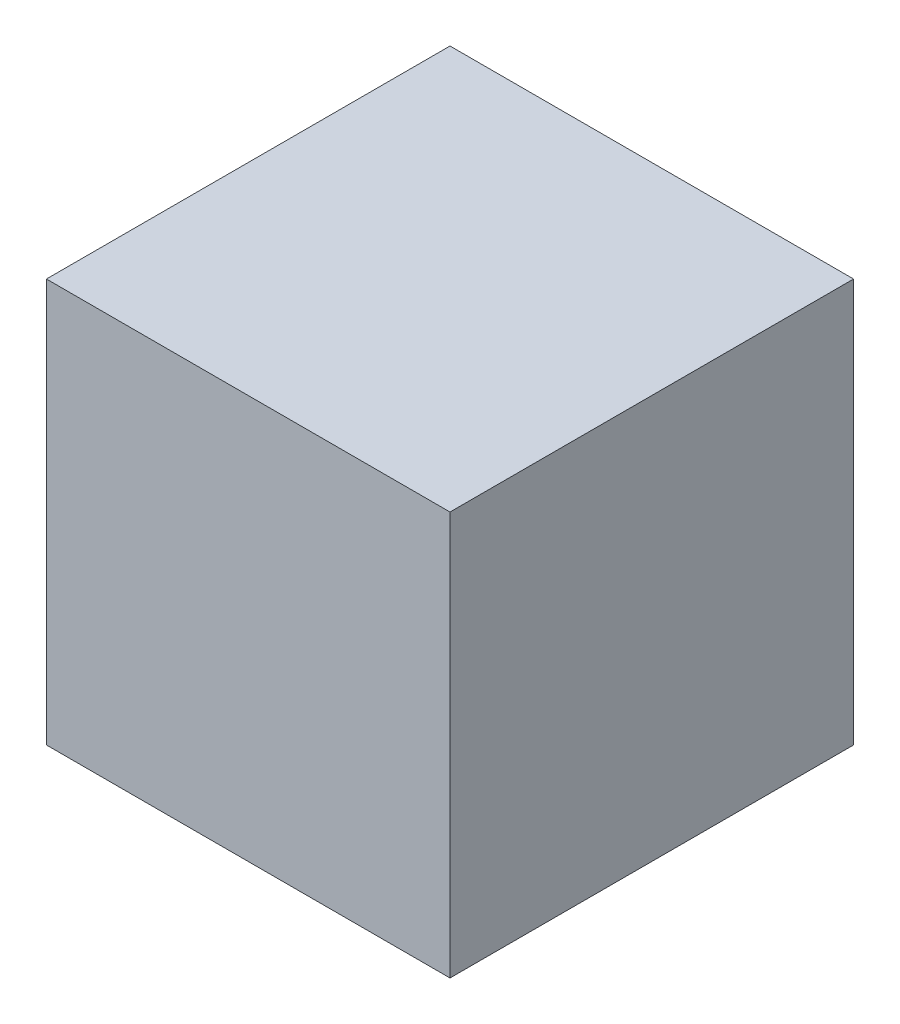
ISO-10303-21;
HEADER;
FILE_DESCRIPTION(('STEP AP214'),'2;1');
FILE_NAME('part.step','',(''),(''),'','','');
FILE_SCHEMA(('AUTOMOTIVE_DESIGN { 1 0 10303 214 1 1 1 1 }'));
ENDSEC;
DATA;
#1=APPLICATION_CONTEXT('core data for automotive mechanical design processes');
#2=APPLICATION_PROTOCOL_DEFINITION('international standard','automotive_design',2000,#1);
#3=PRODUCT_CONTEXT('',#1,'mechanical');
#4=PRODUCT('Part','Part','',(#3));
#5=PRODUCT_RELATED_PRODUCT_CATEGORY('part','',(#4));
#6=PRODUCT_DEFINITION_FORMATION('','',#4);
#7=PRODUCT_DEFINITION_CONTEXT('part definition',#1,'design');
#8=PRODUCT_DEFINITION('design','',#6,#7);
#9=PRODUCT_DEFINITION_SHAPE('','',#8);
#10=(LENGTH_UNIT() NAMED_UNIT(*) SI_UNIT(.MILLI.,.METRE.));
#11=(NAMED_UNIT(*) PLANE_ANGLE_UNIT() SI_UNIT($,.RADIAN.));
#12=(NAMED_UNIT(*) SI_UNIT($,.STERADIAN.) SOLID_ANGLE_UNIT());
#13=UNCERTAINTY_MEASURE_WITH_UNIT(LENGTH_MEASURE(1.E-05),#10,'distance_accuracy_value','');
#14=(GEOMETRIC_REPRESENTATION_CONTEXT(3) GLOBAL_UNCERTAINTY_ASSIGNED_CONTEXT((#13)) GLOBAL_UNIT_ASSIGNED_CONTEXT((#10,
#11,#12)) REPRESENTATION_CONTEXT('',''));
#15=CARTESIAN_POINT('',(0.,0.,0.));
#16=DIRECTION('',(0.,0.,1.));
#17=DIRECTION('',(1.,0.,0.));
#18=AXIS2_PLACEMENT_3D('',#15,#16,#17);
#19=CARTESIAN_POINT('',(12.5,-12.5,12.5));
#20=DIRECTION('',(-1.,0.,0.));
#21=DIRECTION('',(0.,0.,1.));
#22=AXIS2_PLACEMENT_3D('',#19,#20,#21);
#23=PLANE('',#22);
#24=DIRECTION('',(0.,1.,0.));
#25=VECTOR('',#24,1.);
#26=CARTESIAN_POINT('',(12.5,-12.5,-12.5));
#27=LINE('',#26,#25);
#28=CARTESIAN_POINT('',(12.5,-12.5,-12.5));
#29=VERTEX_POINT('',#28);
#30=CARTESIAN_POINT('',(12.5,12.5,-12.5));
#31=VERTEX_POINT('',#30);
#32=EDGE_CURVE('E98',#29,#31,#27,.T.);
#33=ORIENTED_EDGE('',*,*,#32,.T.);
#34=DIRECTION('',(0.,0.,-1.));
#35=VECTOR('',#34,1.);
#36=CARTESIAN_POINT('',(12.5,12.5,12.5));
#37=LINE('',#36,#35);
#38=CARTESIAN_POINT('',(12.5,12.5,12.5));
#39=VERTEX_POINT('',#38);
#40=EDGE_CURVE('E11',#39,#31,#37,.T.);
#41=ORIENTED_EDGE('',*,*,#40,.F.);
#42=DIRECTION('',(0.,1.,0.));
#43=VECTOR('',#42,1.);
#44=CARTESIAN_POINT('',(12.5,-12.5,12.5));
#45=LINE('',#44,#43);
#46=CARTESIAN_POINT('',(12.5,-12.5,12.5));
#47=VERTEX_POINT('',#46);
#48=EDGE_CURVE('E86',#47,#39,#45,.T.);
#49=ORIENTED_EDGE('',*,*,#48,.F.);
#50=DIRECTION('',(0.,0.,-1.));
#51=VECTOR('',#50,1.);
#52=CARTESIAN_POINT('',(12.5,-12.5,12.5));
#53=LINE('',#52,#51);
#54=EDGE_CURVE('E94',#47,#29,#53,.T.);
#55=ORIENTED_EDGE('',*,*,#54,.T.);
#56=EDGE_LOOP('',(#33,#41,#49,#55));
#57=FACE_BOUND('',#56,.T.);
#58=ADVANCED_FACE('F35',(#57),#23,.F.);
#59=CARTESIAN_POINT('',(-12.5,12.5,12.5));
#60=DIRECTION('',(0.,-1.,0.));
#61=DIRECTION('',(0.,0.,-1.));
#62=AXIS2_PLACEMENT_3D('',#59,#60,#61);
#63=PLANE('',#62);
#64=DIRECTION('',(-1.,0.,0.));
#65=VECTOR('',#64,1.);
#66=CARTESIAN_POINT('',(-12.5,12.5,-12.5));
#67=LINE('',#66,#65);
#68=CARTESIAN_POINT('',(-12.5,12.5,-12.5));
#69=VERTEX_POINT('',#68);
#70=EDGE_CURVE('E90',#31,#69,#67,.T.);
#71=ORIENTED_EDGE('',*,*,#70,.T.);
#72=DIRECTION('',(0.,0.,-1.));
#73=VECTOR('',#72,1.);
#74=CARTESIAN_POINT('',(-12.5,12.5,12.5));
#75=LINE('',#74,#73);
#76=CARTESIAN_POINT('',(-12.5,12.5,12.5));
#77=VERTEX_POINT('',#76);
#78=EDGE_CURVE('E43',#77,#69,#75,.T.);
#79=ORIENTED_EDGE('',*,*,#78,.F.);
#80=DIRECTION('',(-1.,0.,0.));
#81=VECTOR('',#80,1.);
#82=CARTESIAN_POINT('',(-12.5,12.5,12.5));
#83=LINE('',#82,#81);
#84=EDGE_CURVE('E81',#39,#77,#83,.T.);
#85=ORIENTED_EDGE('',*,*,#84,.F.);
#86=ORIENTED_EDGE('',*,*,#40,.T.);
#87=EDGE_LOOP('',(#71,#79,#85,#86));
#88=FACE_BOUND('',#87,.T.);
#89=ADVANCED_FACE('F89',(#88),#63,.F.);
#90=CARTESIAN_POINT('',(-12.5,-12.5,12.5));
#91=DIRECTION('',(1.,0.,0.));
#92=DIRECTION('',(0.,0.,-1.));
#93=AXIS2_PLACEMENT_3D('',#90,#91,#92);
#94=PLANE('',#93);
#95=DIRECTION('',(0.,-1.,0.));
#96=VECTOR('',#95,1.);
#97=CARTESIAN_POINT('',(-12.5,-12.5,-12.5));
#98=LINE('',#97,#96);
#99=CARTESIAN_POINT('',(-12.5,-12.5,-12.5));
#100=VERTEX_POINT('',#99);
#101=EDGE_CURVE('E68',#69,#100,#98,.T.);
#102=ORIENTED_EDGE('',*,*,#101,.T.);
#103=DIRECTION('',(0.,0.,-1.));
#104=VECTOR('',#103,1.);
#105=CARTESIAN_POINT('',(-12.5,-12.5,12.5));
#106=LINE('',#105,#104);
#107=CARTESIAN_POINT('',(-12.5,-12.5,12.5));
#108=VERTEX_POINT('',#107);
#109=EDGE_CURVE('E91',#108,#100,#106,.T.);
#110=ORIENTED_EDGE('',*,*,#109,.F.);
#111=DIRECTION('',(0.,-1.,0.));
#112=VECTOR('',#111,1.);
#113=CARTESIAN_POINT('',(-12.5,-12.5,12.5));
#114=LINE('',#113,#112);
#115=EDGE_CURVE('E84',#77,#108,#114,.T.);
#116=ORIENTED_EDGE('',*,*,#115,.F.);
#117=ORIENTED_EDGE('',*,*,#78,.T.);
#118=EDGE_LOOP('',(#102,#110,#116,#117));
#119=FACE_BOUND('',#118,.T.);
#120=ADVANCED_FACE('F92',(#119),#94,.F.);
#121=CARTESIAN_POINT('',(-12.5,-12.5,12.5));
#122=DIRECTION('',(0.,1.,0.));
#123=DIRECTION('',(0.,0.,1.));
#124=AXIS2_PLACEMENT_3D('',#121,#122,#123);
#125=PLANE('',#124);
#126=DIRECTION('',(1.,0.,0.));
#127=VECTOR('',#126,1.);
#128=CARTESIAN_POINT('',(-12.5,-12.5,-12.5));
#129=LINE('',#128,#127);
#130=EDGE_CURVE('E74',#100,#29,#129,.T.);
#131=ORIENTED_EDGE('',*,*,#130,.T.);
#132=ORIENTED_EDGE('',*,*,#54,.F.);
#133=DIRECTION('',(1.,0.,0.));
#134=VECTOR('',#133,1.);
#135=CARTESIAN_POINT('',(-12.5,-12.5,12.5));
#136=LINE('',#135,#134);
#137=EDGE_CURVE('E51',#108,#47,#136,.T.);
#138=ORIENTED_EDGE('',*,*,#137,.F.);
#139=ORIENTED_EDGE('',*,*,#109,.T.);
#140=EDGE_LOOP('',(#131,#132,#138,#139));
#141=FACE_BOUND('',#140,.T.);
#142=ADVANCED_FACE('F105',(#141),#125,.F.);
#143=CARTESIAN_POINT('',(0.,0.,12.5));
#144=DIRECTION('',(0.,0.,-1.));
#145=DIRECTION('',(-1.,0.,0.));
#146=AXIS2_PLACEMENT_3D('',#143,#144,#145);
#147=PLANE('',#146);
#148=ORIENTED_EDGE('',*,*,#48,.T.);
#149=ORIENTED_EDGE('',*,*,#84,.T.);
#150=ORIENTED_EDGE('',*,*,#115,.T.);
#151=ORIENTED_EDGE('',*,*,#137,.T.);
#152=EDGE_LOOP('',(#148,#149,#150,#151));
#153=FACE_BOUND('',#152,.T.);
#154=ADVANCED_FACE('F82',(#153),#147,.F.);
#155=CARTESIAN_POINT('',(0.,0.,-12.5));
#156=DIRECTION('',(0.,0.,-1.));
#157=DIRECTION('',(-1.,0.,0.));
#158=AXIS2_PLACEMENT_3D('',#155,#156,#157);
#159=PLANE('',#158);
#160=ORIENTED_EDGE('',*,*,#32,.F.);
#161=ORIENTED_EDGE('',*,*,#130,.F.);
#162=ORIENTED_EDGE('',*,*,#101,.F.);
#163=ORIENTED_EDGE('',*,*,#70,.F.);
#164=EDGE_LOOP('',(#160,#161,#162,#163));
#165=FACE_BOUND('',#164,.T.);
#166=ADVANCED_FACE('F108',(#165),#159,.T.);
#167=CLOSED_SHELL('',(#58,#89,#120,#142,#154,#166));
#168=MANIFOLD_SOLID_BREP('B2',#167);
#169=ADVANCED_BREP_SHAPE_REPRESENTATION('',(#18,#168),#14);
#170=SHAPE_DEFINITION_REPRESENTATION(#9,#169);
ENDSEC;
END-ISO-10303-21;
